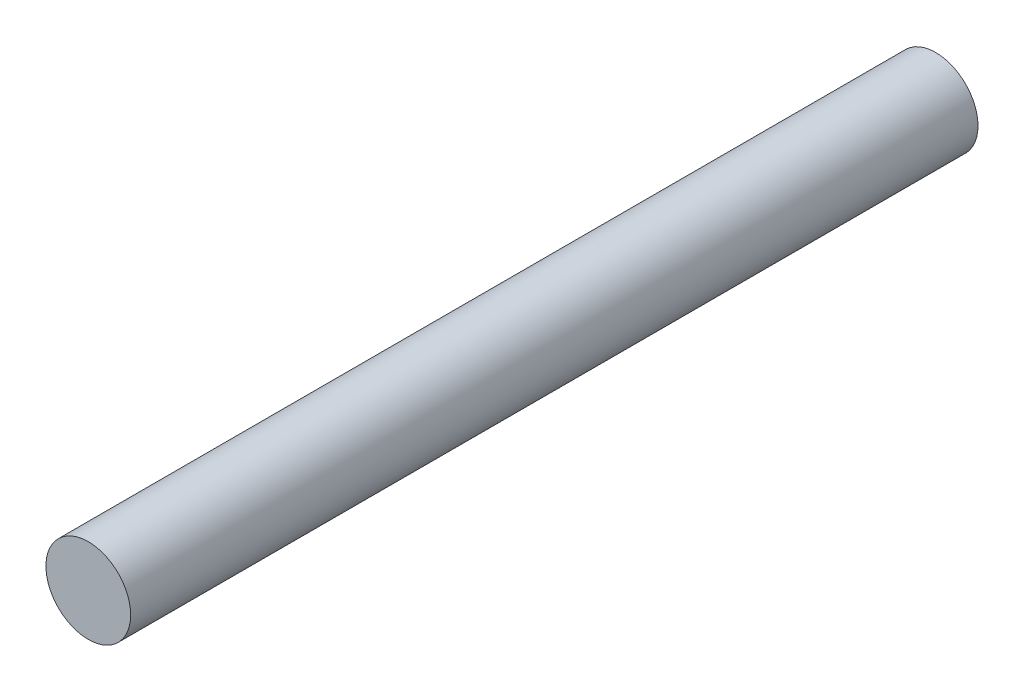
ISO-10303-21;
HEADER;
FILE_DESCRIPTION(('STEP AP214'),'2;1');
FILE_NAME('part.step','',(''),(''),'','','');
FILE_SCHEMA(('AUTOMOTIVE_DESIGN { 1 0 10303 214 1 1 1 1 }'));
ENDSEC;
DATA;
#1=APPLICATION_CONTEXT('core data for automotive mechanical design processes');
#2=APPLICATION_PROTOCOL_DEFINITION('international standard','automotive_design',2000,#1);
#3=PRODUCT_CONTEXT('',#1,'mechanical');
#4=PRODUCT('Part','Part','',(#3));
#5=PRODUCT_RELATED_PRODUCT_CATEGORY('part','',(#4));
#6=PRODUCT_DEFINITION_FORMATION('','',#4);
#7=PRODUCT_DEFINITION_CONTEXT('part definition',#1,'design');
#8=PRODUCT_DEFINITION('design','',#6,#7);
#9=PRODUCT_DEFINITION_SHAPE('','',#8);
#10=(LENGTH_UNIT() NAMED_UNIT(*) SI_UNIT(.MILLI.,.METRE.));
#11=(NAMED_UNIT(*) PLANE_ANGLE_UNIT() SI_UNIT($,.RADIAN.));
#12=(NAMED_UNIT(*) SI_UNIT($,.STERADIAN.) SOLID_ANGLE_UNIT());
#13=UNCERTAINTY_MEASURE_WITH_UNIT(LENGTH_MEASURE(1.E-05),#10,'distance_accuracy_value','');
#14=(GEOMETRIC_REPRESENTATION_CONTEXT(3) GLOBAL_UNCERTAINTY_ASSIGNED_CONTEXT((#13)) GLOBAL_UNIT_ASSIGNED_CONTEXT((#10,
#11,#12)) REPRESENTATION_CONTEXT('',''));
#15=CARTESIAN_POINT('',(0.,0.,0.));
#16=DIRECTION('',(0.,0.,1.));
#17=DIRECTION('',(1.,0.,0.));
#18=AXIS2_PLACEMENT_3D('',#15,#16,#17);
#19=CARTESIAN_POINT('',(0.,0.,30.));
#20=DIRECTION('',(0.,0.,-1.));
#21=DIRECTION('',(-1.,0.,0.));
#22=AXIS2_PLACEMENT_3D('',#19,#20,#21);
#23=CYLINDRICAL_SURFACE('',#22,1.5);
#24=CARTESIAN_POINT('',(0.,0.,30.));
#25=DIRECTION('',(0.,0.,1.));
#26=DIRECTION('',(1.,0.,0.));
#27=AXIS2_PLACEMENT_3D('',#24,#25,#26);
#28=CIRCLE('',#27,1.5);
#29=CARTESIAN_POINT('',(1.5,0.,30.));
#30=VERTEX_POINT('',#29);
#31=EDGE_CURVE('E10',#30,#30,#28,.T.);
#32=ORIENTED_EDGE('',*,*,#31,.F.);
#33=EDGE_LOOP('',(#32));
#34=FACE_BOUND('',#33,.T.);
#35=CARTESIAN_POINT('',(0.,0.,0.));
#36=DIRECTION('',(0.,0.,1.));
#37=DIRECTION('',(1.,0.,0.));
#38=AXIS2_PLACEMENT_3D('',#35,#36,#37);
#39=CIRCLE('',#38,1.5);
#40=CARTESIAN_POINT('',(1.5,0.,0.));
#41=VERTEX_POINT('',#40);
#42=EDGE_CURVE('E35',#41,#41,#39,.T.);
#43=ORIENTED_EDGE('',*,*,#42,.T.);
#44=EDGE_LOOP('',(#43));
#45=FACE_BOUND('',#44,.T.);
#46=ADVANCED_FACE('F32',(#34,#45),#23,.T.);
#47=CARTESIAN_POINT('',(0.,0.,30.));
#48=DIRECTION('',(0.,0.,1.));
#49=DIRECTION('',(1.,0.,0.));
#50=AXIS2_PLACEMENT_3D('',#47,#48,#49);
#51=PLANE('',#50);
#52=ORIENTED_EDGE('',*,*,#31,.T.);
#53=EDGE_LOOP('',(#52));
#54=FACE_BOUND('',#53,.T.);
#55=ADVANCED_FACE('F47',(#54),#51,.T.);
#56=CARTESIAN_POINT('',(0.,0.,0.));
#57=DIRECTION('',(0.,0.,1.));
#58=DIRECTION('',(1.,0.,0.));
#59=AXIS2_PLACEMENT_3D('',#56,#57,#58);
#60=PLANE('',#59);
#61=ORIENTED_EDGE('',*,*,#42,.F.);
#62=EDGE_LOOP('',(#61));
#63=FACE_BOUND('',#62,.T.);
#64=ADVANCED_FACE('F45',(#63),#60,.F.);
#65=CLOSED_SHELL('',(#46,#55,#64));
#66=MANIFOLD_SOLID_BREP('B2',#65);
#67=ADVANCED_BREP_SHAPE_REPRESENTATION('',(#18,#66),#14);
#68=SHAPE_DEFINITION_REPRESENTATION(#9,#67);
ENDSEC;
END-ISO-10303-21;
